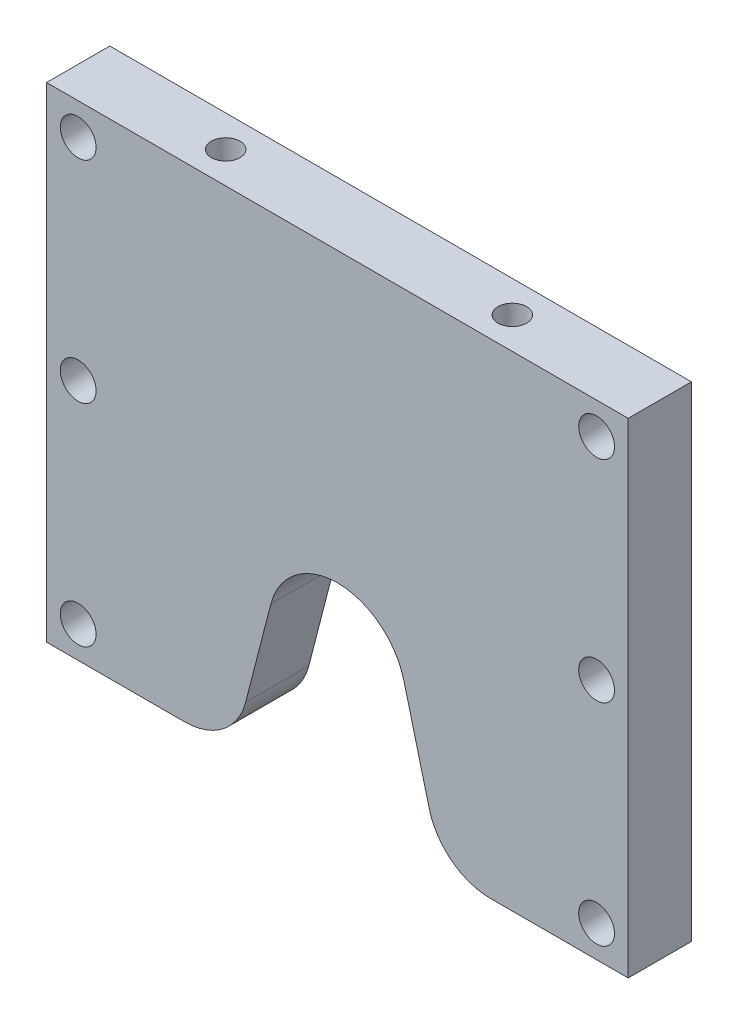
ISO-10303-21;
HEADER;
FILE_DESCRIPTION(('STEP AP214'),'2;1');
FILE_NAME('part.step','',(''),(''),'','','');
FILE_SCHEMA(('AUTOMOTIVE_DESIGN { 1 0 10303 214 1 1 1 1 }'));
ENDSEC;
DATA;
#1=APPLICATION_CONTEXT('core data for automotive mechanical design processes');
#2=APPLICATION_PROTOCOL_DEFINITION('international standard','automotive_design',2000,#1);
#3=PRODUCT_CONTEXT('',#1,'mechanical');
#4=PRODUCT('Part','Part','',(#3));
#5=PRODUCT_RELATED_PRODUCT_CATEGORY('part','',(#4));
#6=PRODUCT_DEFINITION_FORMATION('','',#4);
#7=PRODUCT_DEFINITION_CONTEXT('part definition',#1,'design');
#8=PRODUCT_DEFINITION('design','',#6,#7);
#9=PRODUCT_DEFINITION_SHAPE('','',#8);
#10=(LENGTH_UNIT() NAMED_UNIT(*) SI_UNIT(.MILLI.,.METRE.));
#11=(NAMED_UNIT(*) PLANE_ANGLE_UNIT() SI_UNIT($,.RADIAN.));
#12=(NAMED_UNIT(*) SI_UNIT($,.STERADIAN.) SOLID_ANGLE_UNIT());
#13=UNCERTAINTY_MEASURE_WITH_UNIT(LENGTH_MEASURE(1.E-05),#10,'distance_accuracy_value','');
#14=(GEOMETRIC_REPRESENTATION_CONTEXT(3) GLOBAL_UNCERTAINTY_ASSIGNED_CONTEXT((#13)) GLOBAL_UNIT_ASSIGNED_CONTEXT((#10,
#11,#12)) REPRESENTATION_CONTEXT('',''));
#15=CARTESIAN_POINT('',(0.,0.,0.));
#16=DIRECTION('',(0.,0.,1.));
#17=DIRECTION('',(1.,0.,0.));
#18=AXIS2_PLACEMENT_3D('',#15,#16,#17);
#19=CARTESIAN_POINT('',(-61.5,-50.,7.5));
#20=DIRECTION('',(0.,0.,-1.));
#21=DIRECTION('',(-1.,0.,0.));
#22=AXIS2_PLACEMENT_3D('',#19,#20,#21);
#23=CYLINDRICAL_SURFACE('',#22,4.25000000000001);
#24=CARTESIAN_POINT('',(-61.5,-50.,7.5));
#25=DIRECTION('',(0.,0.,1.));
#26=DIRECTION('',(1.,0.,0.));
#27=AXIS2_PLACEMENT_3D('',#24,#25,#26);
#28=CIRCLE('',#27,4.25000000000001);
#29=CARTESIAN_POINT('',(-57.25,-50.,7.5));
#30=VERTEX_POINT('',#29);
#31=EDGE_CURVE('E248',#30,#30,#28,.T.);
#32=ORIENTED_EDGE('',*,*,#31,.T.);
#33=EDGE_LOOP('',(#32));
#34=FACE_BOUND('',#33,.T.);
#35=CARTESIAN_POINT('',(-61.5,-50.,0.5));
#36=DIRECTION('',(0.,0.,-1.));
#37=DIRECTION('',(-1.,0.,0.));
#38=AXIS2_PLACEMENT_3D('',#35,#36,#37);
#39=CIRCLE('',#38,4.25000000000001);
#40=CARTESIAN_POINT('',(-65.75,-50.,0.5));
#41=VERTEX_POINT('',#40);
#42=EDGE_CURVE('E40',#41,#41,#39,.T.);
#43=ORIENTED_EDGE('',*,*,#42,.T.);
#44=EDGE_LOOP('',(#43));
#45=FACE_BOUND('',#44,.T.);
#46=ADVANCED_FACE('F36',(#34,#45),#23,.F.);
#47=CARTESIAN_POINT('',(-61.5,0.,7.5));
#48=DIRECTION('',(0.,0.,-1.));
#49=DIRECTION('',(-1.,0.,0.));
#50=AXIS2_PLACEMENT_3D('',#47,#48,#49);
#51=CYLINDRICAL_SURFACE('',#50,4.25000000000001);
#52=CARTESIAN_POINT('',(-61.5,0.,7.5));
#53=DIRECTION('',(0.,0.,1.));
#54=DIRECTION('',(1.,0.,0.));
#55=AXIS2_PLACEMENT_3D('',#52,#53,#54);
#56=CIRCLE('',#55,4.25000000000001);
#57=CARTESIAN_POINT('',(-57.25,0.,7.5));
#58=VERTEX_POINT('',#57);
#59=EDGE_CURVE('E251',#58,#58,#56,.T.);
#60=ORIENTED_EDGE('',*,*,#59,.T.);
#61=EDGE_LOOP('',(#60));
#62=FACE_BOUND('',#61,.T.);
#63=CARTESIAN_POINT('',(-61.5,0.,0.5));
#64=DIRECTION('',(0.,0.,-1.));
#65=DIRECTION('',(-1.,0.,0.));
#66=AXIS2_PLACEMENT_3D('',#63,#64,#65);
#67=CIRCLE('',#66,4.25000000000001);
#68=CARTESIAN_POINT('',(-65.75,0.,0.5));
#69=VERTEX_POINT('',#68);
#70=EDGE_CURVE('E207',#69,#69,#67,.T.);
#71=ORIENTED_EDGE('',*,*,#70,.T.);
#72=EDGE_LOOP('',(#71));
#73=FACE_BOUND('',#72,.T.);
#74=ADVANCED_FACE('F299',(#62,#73),#51,.F.);
#75=CARTESIAN_POINT('',(-61.5,50.,7.5));
#76=DIRECTION('',(0.,0.,-1.));
#77=DIRECTION('',(-1.,0.,0.));
#78=AXIS2_PLACEMENT_3D('',#75,#76,#77);
#79=CYLINDRICAL_SURFACE('',#78,4.25000000000001);
#80=CARTESIAN_POINT('',(-61.5,50.,7.5));
#81=DIRECTION('',(0.,0.,1.));
#82=DIRECTION('',(1.,0.,0.));
#83=AXIS2_PLACEMENT_3D('',#80,#81,#82);
#84=CIRCLE('',#83,4.25000000000001);
#85=CARTESIAN_POINT('',(-57.25,50.,7.5));
#86=VERTEX_POINT('',#85);
#87=EDGE_CURVE('E155',#86,#86,#84,.T.);
#88=ORIENTED_EDGE('',*,*,#87,.T.);
#89=EDGE_LOOP('',(#88));
#90=FACE_BOUND('',#89,.T.);
#91=CARTESIAN_POINT('',(-61.5,50.,0.5));
#92=DIRECTION('',(0.,0.,-1.));
#93=DIRECTION('',(-1.,0.,0.));
#94=AXIS2_PLACEMENT_3D('',#91,#92,#93);
#95=CIRCLE('',#94,4.25000000000001);
#96=CARTESIAN_POINT('',(-65.75,50.,0.5));
#97=VERTEX_POINT('',#96);
#98=EDGE_CURVE('E203',#97,#97,#95,.T.);
#99=ORIENTED_EDGE('',*,*,#98,.T.);
#100=EDGE_LOOP('',(#99));
#101=FACE_BOUND('',#100,.T.);
#102=ADVANCED_FACE('F305',(#90,#101),#79,.F.);
#103=CARTESIAN_POINT('',(61.5,-50.,7.5));
#104=DIRECTION('',(0.,0.,-1.));
#105=DIRECTION('',(-1.,0.,0.));
#106=AXIS2_PLACEMENT_3D('',#103,#104,#105);
#107=CYLINDRICAL_SURFACE('',#106,4.25000000000001);
#108=CARTESIAN_POINT('',(61.5,-50.,7.5));
#109=DIRECTION('',(0.,0.,1.));
#110=DIRECTION('',(1.,0.,0.));
#111=AXIS2_PLACEMENT_3D('',#108,#109,#110);
#112=CIRCLE('',#111,4.25000000000001);
#113=CARTESIAN_POINT('',(65.75,-50.,7.5));
#114=VERTEX_POINT('',#113);
#115=EDGE_CURVE('E191',#114,#114,#112,.T.);
#116=ORIENTED_EDGE('',*,*,#115,.T.);
#117=EDGE_LOOP('',(#116));
#118=FACE_BOUND('',#117,.T.);
#119=CARTESIAN_POINT('',(61.5,-50.,0.5));
#120=DIRECTION('',(0.,0.,-1.));
#121=DIRECTION('',(-1.,0.,0.));
#122=AXIS2_PLACEMENT_3D('',#119,#120,#121);
#123=CIRCLE('',#122,4.25000000000001);
#124=CARTESIAN_POINT('',(57.25,-50.,0.5));
#125=VERTEX_POINT('',#124);
#126=EDGE_CURVE('E198',#125,#125,#123,.T.);
#127=ORIENTED_EDGE('',*,*,#126,.T.);
#128=EDGE_LOOP('',(#127));
#129=FACE_BOUND('',#128,.T.);
#130=ADVANCED_FACE('F315',(#118,#129),#107,.F.);
#131=CARTESIAN_POINT('',(61.5,0.,7.5));
#132=DIRECTION('',(0.,0.,-1.));
#133=DIRECTION('',(-1.,0.,0.));
#134=AXIS2_PLACEMENT_3D('',#131,#132,#133);
#135=CYLINDRICAL_SURFACE('',#134,4.25000000000001);
#136=CARTESIAN_POINT('',(61.5,0.,7.5));
#137=DIRECTION('',(0.,0.,1.));
#138=DIRECTION('',(1.,0.,0.));
#139=AXIS2_PLACEMENT_3D('',#136,#137,#138);
#140=CIRCLE('',#139,4.25000000000001);
#141=CARTESIAN_POINT('',(65.75,0.,7.5));
#142=VERTEX_POINT('',#141);
#143=EDGE_CURVE('E242',#142,#142,#140,.T.);
#144=ORIENTED_EDGE('',*,*,#143,.T.);
#145=EDGE_LOOP('',(#144));
#146=FACE_BOUND('',#145,.T.);
#147=CARTESIAN_POINT('',(61.5,0.,0.5));
#148=DIRECTION('',(0.,0.,-1.));
#149=DIRECTION('',(-1.,0.,0.));
#150=AXIS2_PLACEMENT_3D('',#147,#148,#149);
#151=CIRCLE('',#150,4.25000000000001);
#152=CARTESIAN_POINT('',(57.25,0.,0.5));
#153=VERTEX_POINT('',#152);
#154=EDGE_CURVE('E193',#153,#153,#151,.T.);
#155=ORIENTED_EDGE('',*,*,#154,.T.);
#156=EDGE_LOOP('',(#155));
#157=FACE_BOUND('',#156,.T.);
#158=ADVANCED_FACE('F357',(#146,#157),#135,.F.);
#159=CARTESIAN_POINT('',(61.5,50.,7.5));
#160=DIRECTION('',(0.,0.,-1.));
#161=DIRECTION('',(-1.,0.,0.));
#162=AXIS2_PLACEMENT_3D('',#159,#160,#161);
#163=CYLINDRICAL_SURFACE('',#162,4.25000000000001);
#164=CARTESIAN_POINT('',(61.5,50.,7.5));
#165=DIRECTION('',(0.,0.,1.));
#166=DIRECTION('',(1.,0.,0.));
#167=AXIS2_PLACEMENT_3D('',#164,#165,#166);
#168=CIRCLE('',#167,4.25000000000001);
#169=CARTESIAN_POINT('',(65.75,50.,7.5));
#170=VERTEX_POINT('',#169);
#171=EDGE_CURVE('E245',#170,#170,#168,.T.);
#172=ORIENTED_EDGE('',*,*,#171,.T.);
#173=EDGE_LOOP('',(#172));
#174=FACE_BOUND('',#173,.T.);
#175=CARTESIAN_POINT('',(61.5,50.,0.5));
#176=DIRECTION('',(0.,0.,-1.));
#177=DIRECTION('',(-1.,0.,0.));
#178=AXIS2_PLACEMENT_3D('',#175,#176,#177);
#179=CIRCLE('',#178,4.25000000000001);
#180=CARTESIAN_POINT('',(57.25,50.,0.5));
#181=VERTEX_POINT('',#180);
#182=EDGE_CURVE('E188',#181,#181,#179,.T.);
#183=ORIENTED_EDGE('',*,*,#182,.T.);
#184=EDGE_LOOP('',(#183));
#185=FACE_BOUND('',#184,.T.);
#186=ADVANCED_FACE('F310',(#174,#185),#163,.F.);
#187=CARTESIAN_POINT('',(36.3,-42.5,7.5));
#188=DIRECTION('',(0.,0.,-1.));
#189=DIRECTION('',(-1.,0.,0.));
#190=AXIS2_PLACEMENT_3D('',#187,#188,#189);
#191=PLANE('',#190);
#192=ORIENTED_EDGE('',*,*,#143,.F.);
#193=EDGE_LOOP('',(#192));
#194=FACE_BOUND('',#193,.T.);
#195=ORIENTED_EDGE('',*,*,#31,.F.);
#196=EDGE_LOOP('',(#195));
#197=FACE_BOUND('',#196,.T.);
#198=ORIENTED_EDGE('',*,*,#87,.F.);
#199=EDGE_LOOP('',(#198));
#200=FACE_BOUND('',#199,.T.);
#201=DIRECTION('',(0.,-1.,0.));
#202=VECTOR('',#201,1.);
#203=CARTESIAN_POINT('',(-69.,-57.5,7.5));
#204=LINE('',#203,#202);
#205=CARTESIAN_POINT('',(-69.,57.5,7.5));
#206=VERTEX_POINT('',#205);
#207=CARTESIAN_POINT('',(-69.,-57.5,7.5));
#208=VERTEX_POINT('',#207);
#209=EDGE_CURVE('E170',#206,#208,#204,.T.);
#210=ORIENTED_EDGE('',*,*,#209,.T.);
#211=DIRECTION('',(1.,0.,0.));
#212=VECTOR('',#211,1.);
#213=CARTESIAN_POINT('',(-36.3,-57.5,7.5));
#214=LINE('',#213,#212);
#215=CARTESIAN_POINT('',(-36.3,-57.5,7.5));
#216=VERTEX_POINT('',#215);
#217=EDGE_CURVE('E105',#208,#216,#214,.T.);
#218=ORIENTED_EDGE('',*,*,#217,.T.);
#219=CARTESIAN_POINT('',(-36.3,-42.5,7.5));
#220=DIRECTION('',(0.,0.,1.));
#221=DIRECTION('',(1.,0.,0.));
#222=AXIS2_PLACEMENT_3D('',#219,#220,#221);
#223=CIRCLE('',#222,15.);
#224=CARTESIAN_POINT('',(-21.7758941215576,-46.2483794407442,7.5));
#225=VERTEX_POINT('',#224);
#226=EDGE_CURVE('E258',#216,#225,#223,.T.);
#227=ORIENTED_EDGE('',*,*,#226,.T.);
#228=DIRECTION('',(0.24989196271628,0.968273725229496,0.));
#229=VECTOR('',#228,1.);
#230=CARTESIAN_POINT('',(-15.7828617212408,-23.0267610077246,7.5));
#231=LINE('',#230,#229);
#232=CARTESIAN_POINT('',(-15.7828617212408,-23.0267610077246,7.5));
#233=VERTEX_POINT('',#232);
#234=EDGE_CURVE('E260',#225,#233,#231,.T.);
#235=ORIENTED_EDGE('',*,*,#234,.T.);
#236=CARTESIAN_POINT('',(0.,-27.1,7.5));
#237=DIRECTION('',(0.,0.,-1.));
#238=DIRECTION('',(1.,0.,0.));
#239=AXIS2_PLACEMENT_3D('',#236,#237,#238);
#240=CIRCLE('',#239,16.3);
#241=CARTESIAN_POINT('',(15.7828617212408,-23.0267610077247,7.5));
#242=VERTEX_POINT('',#241);
#243=EDGE_CURVE('E262',#233,#242,#240,.T.);
#244=ORIENTED_EDGE('',*,*,#243,.T.);
#245=DIRECTION('',(0.24989196271628,-0.968273725229496,0.));
#246=VECTOR('',#245,1.);
#247=CARTESIAN_POINT('',(15.7828617212408,-23.0267610077247,7.5));
#248=LINE('',#247,#246);
#249=CARTESIAN_POINT('',(21.7758941215576,-46.2483794407442,7.5));
#250=VERTEX_POINT('',#249);
#251=EDGE_CURVE('E264',#242,#250,#248,.T.);
#252=ORIENTED_EDGE('',*,*,#251,.T.);
#253=CARTESIAN_POINT('',(36.3,-42.5,7.5));
#254=DIRECTION('',(0.,0.,1.));
#255=DIRECTION('',(-1.,0.,0.));
#256=AXIS2_PLACEMENT_3D('',#253,#254,#255);
#257=CIRCLE('',#256,15.);
#258=CARTESIAN_POINT('',(36.3,-57.5,7.5));
#259=VERTEX_POINT('',#258);
#260=EDGE_CURVE('E133',#250,#259,#257,.T.);
#261=ORIENTED_EDGE('',*,*,#260,.T.);
#262=DIRECTION('',(1.,0.,0.));
#263=VECTOR('',#262,1.);
#264=CARTESIAN_POINT('',(69.,-57.5,7.5));
#265=LINE('',#264,#263);
#266=CARTESIAN_POINT('',(69.,-57.5,7.5));
#267=VERTEX_POINT('',#266);
#268=EDGE_CURVE('E126',#259,#267,#265,.T.);
#269=ORIENTED_EDGE('',*,*,#268,.T.);
#270=DIRECTION('',(0.,1.,0.));
#271=VECTOR('',#270,1.);
#272=CARTESIAN_POINT('',(69.,-57.5,7.5));
#273=LINE('',#272,#271);
#274=CARTESIAN_POINT('',(69.,57.5,7.5));
#275=VERTEX_POINT('',#274);
#276=EDGE_CURVE('E131',#267,#275,#273,.T.);
#277=ORIENTED_EDGE('',*,*,#276,.T.);
#278=DIRECTION('',(-1.,0.,0.));
#279=VECTOR('',#278,1.);
#280=CARTESIAN_POINT('',(69.,57.5,7.5));
#281=LINE('',#280,#279);
#282=EDGE_CURVE('E55',#275,#206,#281,.T.);
#283=ORIENTED_EDGE('',*,*,#282,.T.);
#284=EDGE_LOOP('',(#210,#218,#227,#235,#244,#252,#261,#269,#277,#283));
#285=FACE_BOUND('',#284,.T.);
#286=ORIENTED_EDGE('',*,*,#59,.F.);
#287=EDGE_LOOP('',(#286));
#288=FACE_BOUND('',#287,.T.);
#289=ORIENTED_EDGE('',*,*,#171,.F.);
#290=EDGE_LOOP('',(#289));
#291=FACE_BOUND('',#290,.T.);
#292=ORIENTED_EDGE('',*,*,#115,.F.);
#293=EDGE_LOOP('',(#292));
#294=FACE_BOUND('',#293,.T.);
#295=ADVANCED_FACE('F128',(#194,#197,#200,#285,#288,#291,#294),#191,.F.);
#296=CARTESIAN_POINT('',(36.3,-42.5,-7.5));
#297=DIRECTION('',(0.,0.,-1.));
#298=DIRECTION('',(-1.,0.,0.));
#299=AXIS2_PLACEMENT_3D('',#296,#297,#298);
#300=PLANE('',#299);
#301=CARTESIAN_POINT('',(-61.5,-50.,-7.5));
#302=DIRECTION('',(0.,0.,-1.));
#303=DIRECTION('',(-1.,0.,0.));
#304=AXIS2_PLACEMENT_3D('',#301,#302,#303);
#305=CIRCLE('',#304,6.5);
#306=CARTESIAN_POINT('',(-68.,-50.,-7.5));
#307=VERTEX_POINT('',#306);
#308=EDGE_CURVE('E223',#307,#307,#305,.T.);
#309=ORIENTED_EDGE('',*,*,#308,.F.);
#310=EDGE_LOOP('',(#309));
#311=FACE_BOUND('',#310,.T.);
#312=CARTESIAN_POINT('',(-61.5,0.,-7.5));
#313=DIRECTION('',(0.,0.,-1.));
#314=DIRECTION('',(-1.,0.,0.));
#315=AXIS2_PLACEMENT_3D('',#312,#313,#314);
#316=CIRCLE('',#315,6.5);
#317=CARTESIAN_POINT('',(-68.,0.,-7.5));
#318=VERTEX_POINT('',#317);
#319=EDGE_CURVE('E216',#318,#318,#316,.T.);
#320=ORIENTED_EDGE('',*,*,#319,.F.);
#321=EDGE_LOOP('',(#320));
#322=FACE_BOUND('',#321,.T.);
#323=CARTESIAN_POINT('',(-61.5,50.,-7.5));
#324=DIRECTION('',(0.,0.,-1.));
#325=DIRECTION('',(-1.,0.,0.));
#326=AXIS2_PLACEMENT_3D('',#323,#324,#325);
#327=CIRCLE('',#326,6.5);
#328=CARTESIAN_POINT('',(-68.,50.,-7.5));
#329=VERTEX_POINT('',#328);
#330=EDGE_CURVE('E209',#329,#329,#327,.T.);
#331=ORIENTED_EDGE('',*,*,#330,.F.);
#332=EDGE_LOOP('',(#331));
#333=FACE_BOUND('',#332,.T.);
#334=CARTESIAN_POINT('',(61.5,-50.,-7.5));
#335=DIRECTION('',(0.,0.,-1.));
#336=DIRECTION('',(-1.,0.,0.));
#337=AXIS2_PLACEMENT_3D('',#334,#335,#336);
#338=CIRCLE('',#337,6.5);
#339=CARTESIAN_POINT('',(55.,-50.,-7.5));
#340=VERTEX_POINT('',#339);
#341=EDGE_CURVE('E205',#340,#340,#338,.T.);
#342=ORIENTED_EDGE('',*,*,#341,.F.);
#343=EDGE_LOOP('',(#342));
#344=FACE_BOUND('',#343,.T.);
#345=CARTESIAN_POINT('',(61.5,0.,-7.5));
#346=DIRECTION('',(0.,0.,-1.));
#347=DIRECTION('',(-1.,0.,0.));
#348=AXIS2_PLACEMENT_3D('',#345,#346,#347);
#349=CIRCLE('',#348,6.5);
#350=CARTESIAN_POINT('',(55.,0.,-7.5));
#351=VERTEX_POINT('',#350);
#352=EDGE_CURVE('E201',#351,#351,#349,.T.);
#353=ORIENTED_EDGE('',*,*,#352,.F.);
#354=EDGE_LOOP('',(#353));
#355=FACE_BOUND('',#354,.T.);
#356=CARTESIAN_POINT('',(61.5,50.,-7.5));
#357=DIRECTION('',(0.,0.,-1.));
#358=DIRECTION('',(-1.,0.,0.));
#359=AXIS2_PLACEMENT_3D('',#356,#357,#358);
#360=CIRCLE('',#359,6.5);
#361=CARTESIAN_POINT('',(55.,50.,-7.5));
#362=VERTEX_POINT('',#361);
#363=EDGE_CURVE('E196',#362,#362,#360,.T.);
#364=ORIENTED_EDGE('',*,*,#363,.F.);
#365=EDGE_LOOP('',(#364));
#366=FACE_BOUND('',#365,.T.);
#367=DIRECTION('',(0.,-1.,0.));
#368=VECTOR('',#367,1.);
#369=CARTESIAN_POINT('',(-69.,-57.5,-7.5));
#370=LINE('',#369,#368);
#371=CARTESIAN_POINT('',(-69.,57.5,-7.5));
#372=VERTEX_POINT('',#371);
#373=CARTESIAN_POINT('',(-69.,-57.5,-7.5));
#374=VERTEX_POINT('',#373);
#375=EDGE_CURVE('E151',#372,#374,#370,.T.);
#376=ORIENTED_EDGE('',*,*,#375,.F.);
#377=DIRECTION('',(-1.,0.,0.));
#378=VECTOR('',#377,1.);
#379=CARTESIAN_POINT('',(69.,57.5,-7.5));
#380=LINE('',#379,#378);
#381=CARTESIAN_POINT('',(69.,57.5,-7.5));
#382=VERTEX_POINT('',#381);
#383=EDGE_CURVE('E97',#382,#372,#380,.T.);
#384=ORIENTED_EDGE('',*,*,#383,.F.);
#385=DIRECTION('',(0.,1.,0.));
#386=VECTOR('',#385,1.);
#387=CARTESIAN_POINT('',(69.,-57.5,-7.5));
#388=LINE('',#387,#386);
#389=CARTESIAN_POINT('',(69.,-57.5,-7.5));
#390=VERTEX_POINT('',#389);
#391=EDGE_CURVE('E91',#390,#382,#388,.T.);
#392=ORIENTED_EDGE('',*,*,#391,.F.);
#393=DIRECTION('',(1.,0.,0.));
#394=VECTOR('',#393,1.);
#395=CARTESIAN_POINT('',(69.,-57.5,-7.5));
#396=LINE('',#395,#394);
#397=CARTESIAN_POINT('',(36.3,-57.5,-7.5));
#398=VERTEX_POINT('',#397);
#399=EDGE_CURVE('E141',#398,#390,#396,.T.);
#400=ORIENTED_EDGE('',*,*,#399,.F.);
#401=CARTESIAN_POINT('',(36.3,-42.5,-7.5));
#402=DIRECTION('',(0.,0.,1.));
#403=DIRECTION('',(-1.,0.,0.));
#404=AXIS2_PLACEMENT_3D('',#401,#402,#403);
#405=CIRCLE('',#404,15.);
#406=CARTESIAN_POINT('',(21.7758941215576,-46.2483794407442,-7.5));
#407=VERTEX_POINT('',#406);
#408=EDGE_CURVE('E165',#407,#398,#405,.T.);
#409=ORIENTED_EDGE('',*,*,#408,.F.);
#410=DIRECTION('',(0.24989196271628,-0.968273725229496,0.));
#411=VECTOR('',#410,1.);
#412=CARTESIAN_POINT('',(15.7828617212408,-23.0267610077247,-7.5));
#413=LINE('',#412,#411);
#414=CARTESIAN_POINT('',(15.7828617212408,-23.0267610077247,-7.5));
#415=VERTEX_POINT('',#414);
#416=EDGE_CURVE('E163',#415,#407,#413,.T.);
#417=ORIENTED_EDGE('',*,*,#416,.F.);
#418=CARTESIAN_POINT('',(0.,-27.1,-7.5));
#419=DIRECTION('',(0.,0.,-1.));
#420=DIRECTION('',(1.,0.,0.));
#421=AXIS2_PLACEMENT_3D('',#418,#419,#420);
#422=CIRCLE('',#421,16.3);
#423=CARTESIAN_POINT('',(-15.7828617212408,-23.0267610077246,-7.5));
#424=VERTEX_POINT('',#423);
#425=EDGE_CURVE('E161',#424,#415,#422,.T.);
#426=ORIENTED_EDGE('',*,*,#425,.F.);
#427=DIRECTION('',(0.24989196271628,0.968273725229496,0.));
#428=VECTOR('',#427,1.);
#429=CARTESIAN_POINT('',(-15.7828617212408,-23.0267610077246,-7.5));
#430=LINE('',#429,#428);
#431=CARTESIAN_POINT('',(-21.7758941215576,-46.2483794407442,-7.5));
#432=VERTEX_POINT('',#431);
#433=EDGE_CURVE('E159',#432,#424,#430,.T.);
#434=ORIENTED_EDGE('',*,*,#433,.F.);
#435=CARTESIAN_POINT('',(-36.3,-42.5,-7.5));
#436=DIRECTION('',(0.,0.,1.));
#437=DIRECTION('',(1.,0.,0.));
#438=AXIS2_PLACEMENT_3D('',#435,#436,#437);
#439=CIRCLE('',#438,15.);
#440=CARTESIAN_POINT('',(-36.3,-57.5,-7.5));
#441=VERTEX_POINT('',#440);
#442=EDGE_CURVE('E157',#441,#432,#439,.T.);
#443=ORIENTED_EDGE('',*,*,#442,.F.);
#444=DIRECTION('',(1.,0.,0.));
#445=VECTOR('',#444,1.);
#446=CARTESIAN_POINT('',(-36.3,-57.5,-7.5));
#447=LINE('',#446,#445);
#448=EDGE_CURVE('E154',#374,#441,#447,.T.);
#449=ORIENTED_EDGE('',*,*,#448,.F.);
#450=EDGE_LOOP('',(#376,#384,#392,#400,#409,#417,#426,#434,#443,#449));
#451=FACE_BOUND('',#450,.T.);
#452=ADVANCED_FACE('F277',(#311,#322,#333,#344,#355,#366,#451),#300,.T.);
#453=CARTESIAN_POINT('',(-69.,-57.5,7.5));
#454=DIRECTION('',(1.,0.,0.));
#455=DIRECTION('',(0.,0.,-1.));
#456=AXIS2_PLACEMENT_3D('',#453,#454,#455);
#457=PLANE('',#456);
#458=ORIENTED_EDGE('',*,*,#375,.T.);
#459=DIRECTION('',(0.,0.,-1.));
#460=VECTOR('',#459,1.);
#461=CARTESIAN_POINT('',(-69.,-57.5,7.5));
#462=LINE('',#461,#460);
#463=EDGE_CURVE('E11',#208,#374,#462,.T.);
#464=ORIENTED_EDGE('',*,*,#463,.F.);
#465=ORIENTED_EDGE('',*,*,#209,.F.);
#466=DIRECTION('',(0.,0.,-1.));
#467=VECTOR('',#466,1.);
#468=CARTESIAN_POINT('',(-69.,57.5,7.5));
#469=LINE('',#468,#467);
#470=EDGE_CURVE('E147',#206,#372,#469,.T.);
#471=ORIENTED_EDGE('',*,*,#470,.T.);
#472=EDGE_LOOP('',(#458,#464,#465,#471));
#473=FACE_BOUND('',#472,.T.);
#474=ADVANCED_FACE('F38',(#473),#457,.F.);
#475=CARTESIAN_POINT('',(-36.3,-57.5,7.5));
#476=DIRECTION('',(0.,1.,0.));
#477=DIRECTION('',(-1.,0.,0.));
#478=AXIS2_PLACEMENT_3D('',#475,#476,#477);
#479=PLANE('',#478);
#480=ORIENTED_EDGE('',*,*,#448,.T.);
#481=DIRECTION('',(0.,0.,-1.));
#482=VECTOR('',#481,1.);
#483=CARTESIAN_POINT('',(-36.3,-57.5,7.5));
#484=LINE('',#483,#482);
#485=EDGE_CURVE('E46',#216,#441,#484,.T.);
#486=ORIENTED_EDGE('',*,*,#485,.F.);
#487=ORIENTED_EDGE('',*,*,#217,.F.);
#488=ORIENTED_EDGE('',*,*,#463,.T.);
#489=EDGE_LOOP('',(#480,#486,#487,#488));
#490=FACE_BOUND('',#489,.T.);
#491=ADVANCED_FACE('F324',(#490),#479,.F.);
#492=CARTESIAN_POINT('',(-36.3,-42.5,7.5));
#493=DIRECTION('',(0.,0.,-1.));
#494=DIRECTION('',(-1.,0.,0.));
#495=AXIS2_PLACEMENT_3D('',#492,#493,#494);
#496=CYLINDRICAL_SURFACE('',#495,15.);
#497=ORIENTED_EDGE('',*,*,#442,.T.);
#498=DIRECTION('',(0.,0.,-1.));
#499=VECTOR('',#498,1.);
#500=CARTESIAN_POINT('',(-21.7758941215576,-46.2483794407442,7.5));
#501=LINE('',#500,#499);
#502=EDGE_CURVE('E183',#225,#432,#501,.T.);
#503=ORIENTED_EDGE('',*,*,#502,.F.);
#504=ORIENTED_EDGE('',*,*,#226,.F.);
#505=ORIENTED_EDGE('',*,*,#485,.T.);
#506=EDGE_LOOP('',(#497,#503,#504,#505));
#507=FACE_BOUND('',#506,.T.);
#508=ADVANCED_FACE('F625',(#507),#496,.T.);
#509=CARTESIAN_POINT('',(-15.7828617212408,-23.0267610077246,7.5));
#510=DIRECTION('',(-0.968273725229496,0.24989196271628,0.));
#511=DIRECTION('',(-0.24989196271628,-0.968273725229496,0.));
#512=AXIS2_PLACEMENT_3D('',#509,#510,#511);
#513=PLANE('',#512);
#514=ORIENTED_EDGE('',*,*,#433,.T.);
#515=DIRECTION('',(0.,0.,-1.));
#516=VECTOR('',#515,1.);
#517=CARTESIAN_POINT('',(-15.7828617212408,-23.0267610077246,7.5));
#518=LINE('',#517,#516);
#519=EDGE_CURVE('E180',#233,#424,#518,.T.);
#520=ORIENTED_EDGE('',*,*,#519,.F.);
#521=ORIENTED_EDGE('',*,*,#234,.F.);
#522=ORIENTED_EDGE('',*,*,#502,.T.);
#523=EDGE_LOOP('',(#514,#520,#521,#522));
#524=FACE_BOUND('',#523,.T.);
#525=ADVANCED_FACE('F632',(#524),#513,.F.);
#526=CARTESIAN_POINT('',(0.,-27.1,7.5));
#527=DIRECTION('',(0.,0.,-1.));
#528=DIRECTION('',(-1.,0.,0.));
#529=AXIS2_PLACEMENT_3D('',#526,#527,#528);
#530=CYLINDRICAL_SURFACE('',#529,16.3);
#531=ORIENTED_EDGE('',*,*,#425,.T.);
#532=DIRECTION('',(0.,0.,-1.));
#533=VECTOR('',#532,1.);
#534=CARTESIAN_POINT('',(15.7828617212408,-23.0267610077247,7.5));
#535=LINE('',#534,#533);
#536=EDGE_CURVE('E177',#242,#415,#535,.T.);
#537=ORIENTED_EDGE('',*,*,#536,.F.);
#538=ORIENTED_EDGE('',*,*,#243,.F.);
#539=ORIENTED_EDGE('',*,*,#519,.T.);
#540=EDGE_LOOP('',(#531,#537,#538,#539));
#541=FACE_BOUND('',#540,.T.);
#542=ADVANCED_FACE('F641',(#541),#530,.F.);
#543=CARTESIAN_POINT('',(15.7828617212408,-23.0267610077247,7.5));
#544=DIRECTION('',(0.968273725229496,0.24989196271628,0.));
#545=DIRECTION('',(-0.24989196271628,0.968273725229496,0.));
#546=AXIS2_PLACEMENT_3D('',#543,#544,#545);
#547=PLANE('',#546);
#548=ORIENTED_EDGE('',*,*,#416,.T.);
#549=DIRECTION('',(0.,0.,-1.));
#550=VECTOR('',#549,1.);
#551=CARTESIAN_POINT('',(21.7758941215576,-46.2483794407442,7.5));
#552=LINE('',#551,#550);
#553=EDGE_CURVE('E174',#250,#407,#552,.T.);
#554=ORIENTED_EDGE('',*,*,#553,.F.);
#555=ORIENTED_EDGE('',*,*,#251,.F.);
#556=ORIENTED_EDGE('',*,*,#536,.T.);
#557=EDGE_LOOP('',(#548,#554,#555,#556));
#558=FACE_BOUND('',#557,.T.);
#559=ADVANCED_FACE('F270',(#558),#547,.F.);
#560=CARTESIAN_POINT('',(36.3,-42.5,7.5));
#561=DIRECTION('',(0.,0.,-1.));
#562=DIRECTION('',(-1.,0.,0.));
#563=AXIS2_PLACEMENT_3D('',#560,#561,#562);
#564=CYLINDRICAL_SURFACE('',#563,15.);
#565=ORIENTED_EDGE('',*,*,#408,.T.);
#566=DIRECTION('',(0.,0.,-1.));
#567=VECTOR('',#566,1.);
#568=CARTESIAN_POINT('',(36.3,-57.5,7.5));
#569=LINE('',#568,#567);
#570=EDGE_CURVE('E142',#259,#398,#569,.T.);
#571=ORIENTED_EDGE('',*,*,#570,.F.);
#572=ORIENTED_EDGE('',*,*,#260,.F.);
#573=ORIENTED_EDGE('',*,*,#553,.T.);
#574=EDGE_LOOP('',(#565,#571,#572,#573));
#575=FACE_BOUND('',#574,.T.);
#576=ADVANCED_FACE('F274',(#575),#564,.T.);
#577=CARTESIAN_POINT('',(69.,-57.5,7.5));
#578=DIRECTION('',(0.,1.,0.));
#579=DIRECTION('',(-1.,0.,0.));
#580=AXIS2_PLACEMENT_3D('',#577,#578,#579);
#581=PLANE('',#580);
#582=ORIENTED_EDGE('',*,*,#399,.T.);
#583=DIRECTION('',(0.,0.,-1.));
#584=VECTOR('',#583,1.);
#585=CARTESIAN_POINT('',(69.,-57.5,7.5));
#586=LINE('',#585,#584);
#587=EDGE_CURVE('E138',#267,#390,#586,.T.);
#588=ORIENTED_EDGE('',*,*,#587,.F.);
#589=ORIENTED_EDGE('',*,*,#268,.F.);
#590=ORIENTED_EDGE('',*,*,#570,.T.);
#591=EDGE_LOOP('',(#582,#588,#589,#590));
#592=FACE_BOUND('',#591,.T.);
#593=ADVANCED_FACE('F139',(#592),#581,.F.);
#594=CARTESIAN_POINT('',(69.,-57.5,7.5));
#595=DIRECTION('',(-1.,0.,0.));
#596=DIRECTION('',(0.,0.,1.));
#597=AXIS2_PLACEMENT_3D('',#594,#595,#596);
#598=PLANE('',#597);
#599=ORIENTED_EDGE('',*,*,#391,.T.);
#600=DIRECTION('',(0.,0.,-1.));
#601=VECTOR('',#600,1.);
#602=CARTESIAN_POINT('',(69.,57.5,7.5));
#603=LINE('',#602,#601);
#604=EDGE_CURVE('E143',#275,#382,#603,.T.);
#605=ORIENTED_EDGE('',*,*,#604,.F.);
#606=ORIENTED_EDGE('',*,*,#276,.F.);
#607=ORIENTED_EDGE('',*,*,#587,.T.);
#608=EDGE_LOOP('',(#599,#605,#606,#607));
#609=FACE_BOUND('',#608,.T.);
#610=ADVANCED_FACE('F145',(#609),#598,.F.);
#611=CARTESIAN_POINT('',(69.,57.5,7.5));
#612=DIRECTION('',(0.,-1.,0.));
#613=DIRECTION('',(0.,0.,-1.));
#614=AXIS2_PLACEMENT_3D('',#611,#612,#613);
#615=PLANE('',#614);
#616=CARTESIAN_POINT('',(-34.,57.5,0.));
#617=DIRECTION('',(0.,1.,0.));
#618=DIRECTION('',(0.,0.,1.));
#619=AXIS2_PLACEMENT_3D('',#616,#617,#618);
#620=CIRCLE('',#619,3.39999999999999);
#621=CARTESIAN_POINT('',(-34.,57.5,3.39999999999999));
#622=VERTEX_POINT('',#621);
#623=EDGE_CURVE('E529',#622,#622,#620,.T.);
#624=ORIENTED_EDGE('',*,*,#623,.F.);
#625=EDGE_LOOP('',(#624));
#626=FACE_BOUND('',#625,.T.);
#627=CARTESIAN_POINT('',(34.,57.5,0.));
#628=DIRECTION('',(0.,1.,0.));
#629=DIRECTION('',(0.,0.,1.));
#630=AXIS2_PLACEMENT_3D('',#627,#628,#629);
#631=CIRCLE('',#630,3.39999999999999);
#632=CARTESIAN_POINT('',(34.,57.5,3.39999999999999));
#633=VERTEX_POINT('',#632);
#634=EDGE_CURVE('E531',#633,#633,#631,.T.);
#635=ORIENTED_EDGE('',*,*,#634,.F.);
#636=EDGE_LOOP('',(#635));
#637=FACE_BOUND('',#636,.T.);
#638=ORIENTED_EDGE('',*,*,#383,.T.);
#639=ORIENTED_EDGE('',*,*,#470,.F.);
#640=ORIENTED_EDGE('',*,*,#282,.F.);
#641=ORIENTED_EDGE('',*,*,#604,.T.);
#642=EDGE_LOOP('',(#638,#639,#640,#641));
#643=FACE_BOUND('',#642,.T.);
#644=ADVANCED_FACE('F282',(#626,#637,#643),#615,.F.);
#645=CARTESIAN_POINT('',(61.5,50.,0.5));
#646=DIRECTION('',(0.,0.,-1.));
#647=DIRECTION('',(-1.,0.,0.));
#648=AXIS2_PLACEMENT_3D('',#645,#646,#647);
#649=CYLINDRICAL_SURFACE('',#648,6.5);
#650=CARTESIAN_POINT('',(61.5,50.,0.5));
#651=DIRECTION('',(0.,0.,-1.));
#652=DIRECTION('',(-1.,0.,0.));
#653=AXIS2_PLACEMENT_3D('',#650,#651,#652);
#654=CIRCLE('',#653,6.5);
#655=CARTESIAN_POINT('',(55.,50.,0.5));
#656=VERTEX_POINT('',#655);
#657=EDGE_CURVE('E192',#656,#656,#654,.T.);
#658=ORIENTED_EDGE('',*,*,#657,.F.);
#659=EDGE_LOOP('',(#658));
#660=FACE_BOUND('',#659,.T.);
#661=ORIENTED_EDGE('',*,*,#363,.T.);
#662=EDGE_LOOP('',(#661));
#663=FACE_BOUND('',#662,.T.);
#664=ADVANCED_FACE('F284',(#660,#663),#649,.F.);
#665=CARTESIAN_POINT('',(61.5,50.,0.5));
#666=DIRECTION('',(0.,0.,-1.));
#667=DIRECTION('',(-1.,0.,0.));
#668=AXIS2_PLACEMENT_3D('',#665,#666,#667);
#669=PLANE('',#668);
#670=ORIENTED_EDGE('',*,*,#182,.F.);
#671=EDGE_LOOP('',(#670));
#672=FACE_BOUND('',#671,.T.);
#673=ORIENTED_EDGE('',*,*,#657,.T.);
#674=EDGE_LOOP('',(#673));
#675=FACE_BOUND('',#674,.T.);
#676=ADVANCED_FACE('F291',(#672,#675),#669,.T.);
#677=CARTESIAN_POINT('',(61.5,0.,0.5));
#678=DIRECTION('',(0.,0.,-1.));
#679=DIRECTION('',(-1.,0.,0.));
#680=AXIS2_PLACEMENT_3D('',#677,#678,#679);
#681=CYLINDRICAL_SURFACE('',#680,6.5);
#682=CARTESIAN_POINT('',(61.5,0.,0.5));
#683=DIRECTION('',(0.,0.,-1.));
#684=DIRECTION('',(-1.,0.,0.));
#685=AXIS2_PLACEMENT_3D('',#682,#683,#684);
#686=CIRCLE('',#685,6.5);
#687=CARTESIAN_POINT('',(55.,0.,0.5));
#688=VERTEX_POINT('',#687);
#689=EDGE_CURVE('E197',#688,#688,#686,.T.);
#690=ORIENTED_EDGE('',*,*,#689,.F.);
#691=EDGE_LOOP('',(#690));
#692=FACE_BOUND('',#691,.T.);
#693=ORIENTED_EDGE('',*,*,#352,.T.);
#694=EDGE_LOOP('',(#693));
#695=FACE_BOUND('',#694,.T.);
#696=ADVANCED_FACE('F339',(#692,#695),#681,.F.);
#697=CARTESIAN_POINT('',(61.5,0.,0.5));
#698=DIRECTION('',(0.,0.,-1.));
#699=DIRECTION('',(-1.,0.,0.));
#700=AXIS2_PLACEMENT_3D('',#697,#698,#699);
#701=PLANE('',#700);
#702=ORIENTED_EDGE('',*,*,#154,.F.);
#703=EDGE_LOOP('',(#702));
#704=FACE_BOUND('',#703,.T.);
#705=ORIENTED_EDGE('',*,*,#689,.T.);
#706=EDGE_LOOP('',(#705));
#707=FACE_BOUND('',#706,.T.);
#708=ADVANCED_FACE('F341',(#704,#707),#701,.T.);
#709=CARTESIAN_POINT('',(61.5,-50.,0.5));
#710=DIRECTION('',(0.,0.,-1.));
#711=DIRECTION('',(-1.,0.,0.));
#712=AXIS2_PLACEMENT_3D('',#709,#710,#711);
#713=CYLINDRICAL_SURFACE('',#712,6.5);
#714=CARTESIAN_POINT('',(61.5,-50.,0.5));
#715=DIRECTION('',(0.,0.,-1.));
#716=DIRECTION('',(-1.,0.,0.));
#717=AXIS2_PLACEMENT_3D('',#714,#715,#716);
#718=CIRCLE('',#717,6.5);
#719=CARTESIAN_POINT('',(55.,-50.,0.5));
#720=VERTEX_POINT('',#719);
#721=EDGE_CURVE('E202',#720,#720,#718,.T.);
#722=ORIENTED_EDGE('',*,*,#721,.F.);
#723=EDGE_LOOP('',(#722));
#724=FACE_BOUND('',#723,.T.);
#725=ORIENTED_EDGE('',*,*,#341,.T.);
#726=EDGE_LOOP('',(#725));
#727=FACE_BOUND('',#726,.T.);
#728=ADVANCED_FACE('F348',(#724,#727),#713,.F.);
#729=CARTESIAN_POINT('',(61.5,-50.,0.5));
#730=DIRECTION('',(0.,0.,-1.));
#731=DIRECTION('',(-1.,0.,0.));
#732=AXIS2_PLACEMENT_3D('',#729,#730,#731);
#733=PLANE('',#732);
#734=ORIENTED_EDGE('',*,*,#126,.F.);
#735=EDGE_LOOP('',(#734));
#736=FACE_BOUND('',#735,.T.);
#737=ORIENTED_EDGE('',*,*,#721,.T.);
#738=EDGE_LOOP('',(#737));
#739=FACE_BOUND('',#738,.T.);
#740=ADVANCED_FACE('F386',(#736,#739),#733,.T.);
#741=CARTESIAN_POINT('',(-61.5,50.,0.5));
#742=DIRECTION('',(0.,0.,-1.));
#743=DIRECTION('',(-1.,0.,0.));
#744=AXIS2_PLACEMENT_3D('',#741,#742,#743);
#745=CYLINDRICAL_SURFACE('',#744,6.5);
#746=CARTESIAN_POINT('',(-61.5,50.,0.5));
#747=DIRECTION('',(0.,0.,-1.));
#748=DIRECTION('',(-1.,0.,0.));
#749=AXIS2_PLACEMENT_3D('',#746,#747,#748);
#750=CIRCLE('',#749,6.5);
#751=CARTESIAN_POINT('',(-68.,50.,0.5));
#752=VERTEX_POINT('',#751);
#753=EDGE_CURVE('E206',#752,#752,#750,.T.);
#754=ORIENTED_EDGE('',*,*,#753,.F.);
#755=EDGE_LOOP('',(#754));
#756=FACE_BOUND('',#755,.T.);
#757=ORIENTED_EDGE('',*,*,#330,.T.);
#758=EDGE_LOOP('',(#757));
#759=FACE_BOUND('',#758,.T.);
#760=ADVANCED_FACE('F380',(#756,#759),#745,.F.);
#761=CARTESIAN_POINT('',(-61.5,50.,0.5));
#762=DIRECTION('',(0.,0.,-1.));
#763=DIRECTION('',(-1.,0.,0.));
#764=AXIS2_PLACEMENT_3D('',#761,#762,#763);
#765=PLANE('',#764);
#766=ORIENTED_EDGE('',*,*,#98,.F.);
#767=EDGE_LOOP('',(#766));
#768=FACE_BOUND('',#767,.T.);
#769=ORIENTED_EDGE('',*,*,#753,.T.);
#770=EDGE_LOOP('',(#769));
#771=FACE_BOUND('',#770,.T.);
#772=ADVANCED_FACE('F376',(#768,#771),#765,.T.);
#773=CARTESIAN_POINT('',(-61.5,0.,0.5));
#774=DIRECTION('',(0.,0.,-1.));
#775=DIRECTION('',(-1.,0.,0.));
#776=AXIS2_PLACEMENT_3D('',#773,#774,#775);
#777=CYLINDRICAL_SURFACE('',#776,6.5);
#778=CARTESIAN_POINT('',(-61.5,0.,0.5));
#779=DIRECTION('',(0.,0.,-1.));
#780=DIRECTION('',(-1.,0.,0.));
#781=AXIS2_PLACEMENT_3D('',#778,#779,#780);
#782=CIRCLE('',#781,6.5);
#783=CARTESIAN_POINT('',(-68.,0.,0.5));
#784=VERTEX_POINT('',#783);
#785=EDGE_CURVE('E210',#784,#784,#782,.T.);
#786=ORIENTED_EDGE('',*,*,#785,.F.);
#787=EDGE_LOOP('',(#786));
#788=FACE_BOUND('',#787,.T.);
#789=ORIENTED_EDGE('',*,*,#319,.T.);
#790=EDGE_LOOP('',(#789));
#791=FACE_BOUND('',#790,.T.);
#792=ADVANCED_FACE('F379',(#788,#791),#777,.F.);
#793=CARTESIAN_POINT('',(-61.5,0.,0.5));
#794=DIRECTION('',(0.,0.,-1.));
#795=DIRECTION('',(-1.,0.,0.));
#796=AXIS2_PLACEMENT_3D('',#793,#794,#795);
#797=PLANE('',#796);
#798=ORIENTED_EDGE('',*,*,#70,.F.);
#799=EDGE_LOOP('',(#798));
#800=FACE_BOUND('',#799,.T.);
#801=ORIENTED_EDGE('',*,*,#785,.T.);
#802=EDGE_LOOP('',(#801));
#803=FACE_BOUND('',#802,.T.);
#804=ADVANCED_FACE('F426',(#800,#803),#797,.T.);
#805=CARTESIAN_POINT('',(-61.5,-50.,0.5));
#806=DIRECTION('',(0.,0.,-1.));
#807=DIRECTION('',(-1.,0.,0.));
#808=AXIS2_PLACEMENT_3D('',#805,#806,#807);
#809=CYLINDRICAL_SURFACE('',#808,6.5);
#810=CARTESIAN_POINT('',(-61.5,-50.,0.5));
#811=DIRECTION('',(0.,0.,-1.));
#812=DIRECTION('',(-1.,0.,0.));
#813=AXIS2_PLACEMENT_3D('',#810,#811,#812);
#814=CIRCLE('',#813,6.5);
#815=CARTESIAN_POINT('',(-68.,-50.,0.5));
#816=VERTEX_POINT('',#815);
#817=EDGE_CURVE('E538',#816,#816,#814,.T.);
#818=ORIENTED_EDGE('',*,*,#817,.F.);
#819=EDGE_LOOP('',(#818));
#820=FACE_BOUND('',#819,.T.);
#821=ORIENTED_EDGE('',*,*,#308,.T.);
#822=EDGE_LOOP('',(#821));
#823=FACE_BOUND('',#822,.T.);
#824=ADVANCED_FACE('F435',(#820,#823),#809,.F.);
#825=CARTESIAN_POINT('',(-61.5,-50.,0.5));
#826=DIRECTION('',(0.,0.,-1.));
#827=DIRECTION('',(-1.,0.,0.));
#828=AXIS2_PLACEMENT_3D('',#825,#826,#827);
#829=PLANE('',#828);
#830=ORIENTED_EDGE('',*,*,#42,.F.);
#831=EDGE_LOOP('',(#830));
#832=FACE_BOUND('',#831,.T.);
#833=ORIENTED_EDGE('',*,*,#817,.T.);
#834=EDGE_LOOP('',(#833));
#835=FACE_BOUND('',#834,.T.);
#836=ADVANCED_FACE('F445',(#832,#835),#829,.T.);
#837=CARTESIAN_POINT('',(34.,37.5,0.));
#838=DIRECTION('',(0.,1.,0.));
#839=DIRECTION('',(0.,0.,1.));
#840=AXIS2_PLACEMENT_3D('',#837,#838,#839);
#841=CONICAL_SURFACE('',#840,3.39999999999999,1.02974425867665);
#842=CARTESIAN_POINT('',(34.,35.4570738953063,0.));
#843=VERTEX_POINT('',#842);
#844=VERTEX_LOOP('',#843);
#845=FACE_BOUND('',#844,.T.);
#846=CARTESIAN_POINT('',(34.,37.5,0.));
#847=DIRECTION('',(0.,1.,0.));
#848=DIRECTION('',(0.,0.,1.));
#849=AXIS2_PLACEMENT_3D('',#846,#847,#848);
#850=CIRCLE('',#849,3.39999999999999);
#851=CARTESIAN_POINT('',(34.,37.5,3.39999999999999));
#852=VERTEX_POINT('',#851);
#853=EDGE_CURVE('E536',#852,#852,#850,.T.);
#854=ORIENTED_EDGE('',*,*,#853,.T.);
#855=EDGE_LOOP('',(#854));
#856=FACE_BOUND('',#855,.T.);
#857=ADVANCED_FACE('F454',(#845,#856),#841,.F.);
#858=CARTESIAN_POINT('',(34.,57.5,0.));
#859=DIRECTION('',(0.,1.,0.));
#860=DIRECTION('',(0.,0.,1.));
#861=AXIS2_PLACEMENT_3D('',#858,#859,#860);
#862=CYLINDRICAL_SURFACE('',#861,3.39999999999999);
#863=ORIENTED_EDGE('',*,*,#853,.F.);
#864=EDGE_LOOP('',(#863));
#865=FACE_BOUND('',#864,.T.);
#866=ORIENTED_EDGE('',*,*,#634,.T.);
#867=EDGE_LOOP('',(#866));
#868=FACE_BOUND('',#867,.T.);
#869=ADVANCED_FACE('F471',(#865,#868),#862,.F.);
#870=CARTESIAN_POINT('',(-34.,37.5,0.));
#871=DIRECTION('',(0.,1.,0.));
#872=DIRECTION('',(0.,0.,1.));
#873=AXIS2_PLACEMENT_3D('',#870,#871,#872);
#874=CONICAL_SURFACE('',#873,3.39999999999999,1.02974425867665);
#875=CARTESIAN_POINT('',(-34.,35.4570738953063,0.));
#876=VERTEX_POINT('',#875);
#877=VERTEX_LOOP('',#876);
#878=FACE_BOUND('',#877,.T.);
#879=CARTESIAN_POINT('',(-34.,37.5,0.));
#880=DIRECTION('',(0.,1.,0.));
#881=DIRECTION('',(0.,0.,1.));
#882=AXIS2_PLACEMENT_3D('',#879,#880,#881);
#883=CIRCLE('',#882,3.39999999999999);
#884=CARTESIAN_POINT('',(-34.,37.5,3.39999999999999));
#885=VERTEX_POINT('',#884);
#886=EDGE_CURVE('E527',#885,#885,#883,.T.);
#887=ORIENTED_EDGE('',*,*,#886,.T.);
#888=EDGE_LOOP('',(#887));
#889=FACE_BOUND('',#888,.T.);
#890=ADVANCED_FACE('F482',(#878,#889),#874,.F.);
#891=CARTESIAN_POINT('',(-34.,57.5,0.));
#892=DIRECTION('',(0.,1.,0.));
#893=DIRECTION('',(0.,0.,1.));
#894=AXIS2_PLACEMENT_3D('',#891,#892,#893);
#895=CYLINDRICAL_SURFACE('',#894,3.39999999999999);
#896=ORIENTED_EDGE('',*,*,#886,.F.);
#897=EDGE_LOOP('',(#896));
#898=FACE_BOUND('',#897,.T.);
#899=ORIENTED_EDGE('',*,*,#623,.T.);
#900=EDGE_LOOP('',(#899));
#901=FACE_BOUND('',#900,.T.);
#902=ADVANCED_FACE('F494',(#898,#901),#895,.F.);
#903=CLOSED_SHELL('',(#46,#74,#102,#130,#158,#186,#295,#452,#474,#491,#508,#525,#542,#559,#576,
#593,#610,#644,#664,#676,#696,#708,#728,#740,#760,#772,#792,#804,#824,#836,#857,#869,#890,#902));
#904=MANIFOLD_SOLID_BREP('B2',#903);
#905=ADVANCED_BREP_SHAPE_REPRESENTATION('',(#18,#904),#14);
#906=SHAPE_DEFINITION_REPRESENTATION(#9,#905);
ENDSEC;
END-ISO-10303-21;
